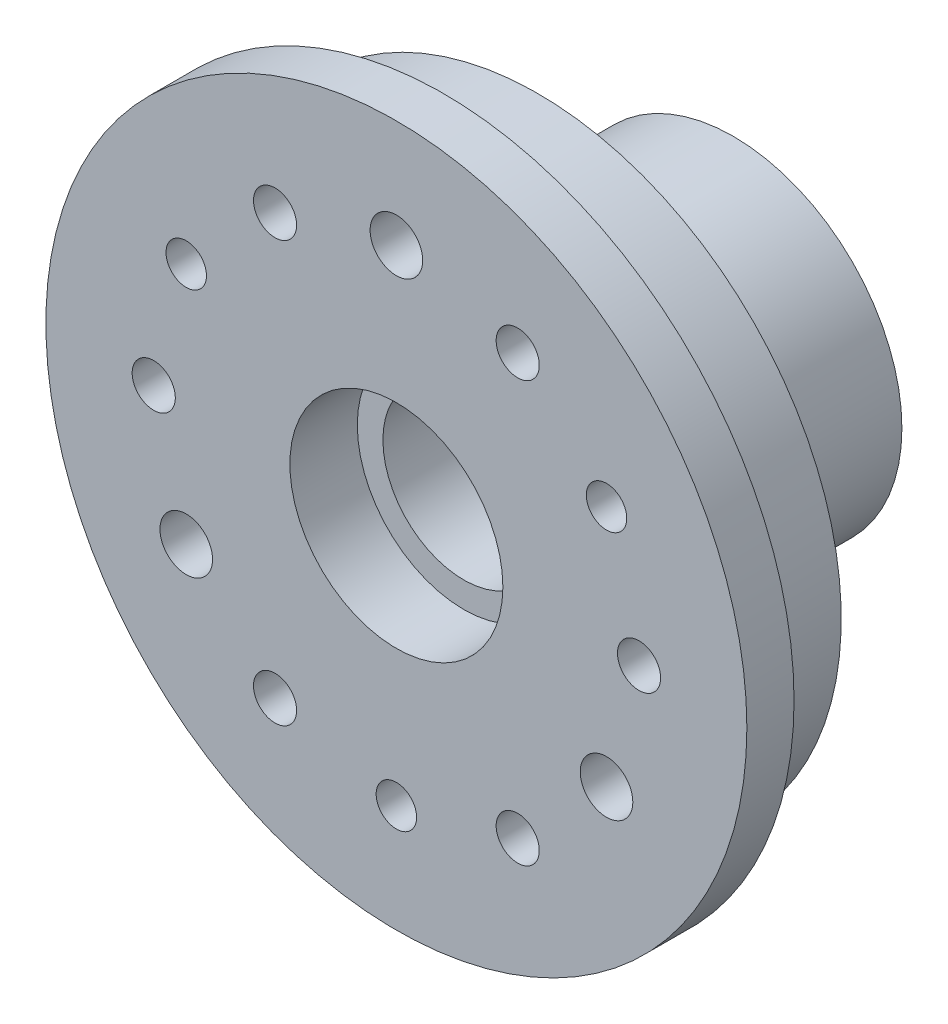
ISO-10303-21;
HEADER;
FILE_DESCRIPTION(('STEP AP214'),'2;1');
FILE_NAME('part.step','',(''),(''),'','','');
FILE_SCHEMA(('AUTOMOTIVE_DESIGN { 1 0 10303 214 1 1 1 1 }'));
ENDSEC;
DATA;
#1=APPLICATION_CONTEXT('core data for automotive mechanical design processes');
#2=APPLICATION_PROTOCOL_DEFINITION('international standard','automotive_design',2000,#1);
#3=PRODUCT_CONTEXT('',#1,'mechanical');
#4=PRODUCT('Part','Part','',(#3));
#5=PRODUCT_RELATED_PRODUCT_CATEGORY('part','',(#4));
#6=PRODUCT_DEFINITION_FORMATION('','',#4);
#7=PRODUCT_DEFINITION_CONTEXT('part definition',#1,'design');
#8=PRODUCT_DEFINITION('design','',#6,#7);
#9=PRODUCT_DEFINITION_SHAPE('','',#8);
#10=(LENGTH_UNIT() NAMED_UNIT(*) SI_UNIT(.MILLI.,.METRE.));
#11=(NAMED_UNIT(*) PLANE_ANGLE_UNIT() SI_UNIT($,.RADIAN.));
#12=(NAMED_UNIT(*) SI_UNIT($,.STERADIAN.) SOLID_ANGLE_UNIT());
#13=UNCERTAINTY_MEASURE_WITH_UNIT(LENGTH_MEASURE(1.E-05),#10,'distance_accuracy_value','');
#14=(GEOMETRIC_REPRESENTATION_CONTEXT(3) GLOBAL_UNCERTAINTY_ASSIGNED_CONTEXT((#13)) GLOBAL_UNIT_ASSIGNED_CONTEXT((#10,
#11,#12)) REPRESENTATION_CONTEXT('',''));
#15=CARTESIAN_POINT('',(0.,0.,0.));
#16=DIRECTION('',(0.,0.,1.));
#17=DIRECTION('',(1.,0.,0.));
#18=AXIS2_PLACEMENT_3D('',#15,#16,#17);
#19=CARTESIAN_POINT('',(-15.5884572681199,8.99999999999991,0.));
#20=DIRECTION('',(0.,0.,1.));
#21=DIRECTION('',(1.,0.,0.));
#22=AXIS2_PLACEMENT_3D('',#19,#20,#21);
#23=CYLINDRICAL_SURFACE('',#22,1.5);
#24=CARTESIAN_POINT('',(-15.5884572681199,8.99999999999991,20.));
#25=DIRECTION('',(0.,0.,1.));
#26=DIRECTION('',(1.,0.,0.));
#27=AXIS2_PLACEMENT_3D('',#24,#25,#26);
#28=CIRCLE('',#27,1.5);
#29=CARTESIAN_POINT('',(-14.0884572681199,8.99999999999991,20.));
#30=VERTEX_POINT('',#29);
#31=EDGE_CURVE('E175',#30,#30,#28,.T.);
#32=ORIENTED_EDGE('',*,*,#31,.T.);
#33=EDGE_LOOP('',(#32));
#34=FACE_BOUND('',#33,.T.);
#35=CARTESIAN_POINT('',(-15.5884572681199,8.99999999999991,14.5));
#36=DIRECTION('',(0.,0.,-1.));
#37=DIRECTION('',(-1.,0.,0.));
#38=AXIS2_PLACEMENT_3D('',#35,#36,#37);
#39=CIRCLE('',#38,1.5);
#40=CARTESIAN_POINT('',(-17.0884572681199,8.99999999999991,14.5));
#41=VERTEX_POINT('',#40);
#42=EDGE_CURVE('E75',#41,#41,#39,.F.);
#43=ORIENTED_EDGE('',*,*,#42,.F.);
#44=EDGE_LOOP('',(#43));
#45=FACE_BOUND('',#44,.T.);
#46=ADVANCED_FACE('F43',(#34,#45),#23,.F.);
#47=CARTESIAN_POINT('',(0.,-18.,0.));
#48=DIRECTION('',(0.,0.,1.));
#49=DIRECTION('',(1.,0.,0.));
#50=AXIS2_PLACEMENT_3D('',#47,#48,#49);
#51=CYLINDRICAL_SURFACE('',#50,1.5);
#52=CARTESIAN_POINT('',(0.,-18.,20.));
#53=DIRECTION('',(0.,0.,1.));
#54=DIRECTION('',(1.,0.,0.));
#55=AXIS2_PLACEMENT_3D('',#52,#53,#54);
#56=CIRCLE('',#55,1.5);
#57=CARTESIAN_POINT('',(1.5000000000001,-18.,20.));
#58=VERTEX_POINT('',#57);
#59=EDGE_CURVE('E180',#58,#58,#56,.T.);
#60=ORIENTED_EDGE('',*,*,#59,.T.);
#61=EDGE_LOOP('',(#60));
#62=FACE_BOUND('',#61,.T.);
#63=CARTESIAN_POINT('',(0.,-18.,14.5));
#64=DIRECTION('',(0.,0.,-1.));
#65=DIRECTION('',(-1.,0.,0.));
#66=AXIS2_PLACEMENT_3D('',#63,#64,#65);
#67=CIRCLE('',#66,1.5);
#68=CARTESIAN_POINT('',(-1.4999999999999,-18.,14.5));
#69=VERTEX_POINT('',#68);
#70=EDGE_CURVE('E71',#69,#69,#67,.F.);
#71=ORIENTED_EDGE('',*,*,#70,.F.);
#72=EDGE_LOOP('',(#71));
#73=FACE_BOUND('',#72,.T.);
#74=ADVANCED_FACE('F233',(#62,#73),#51,.F.);
#75=CARTESIAN_POINT('',(15.5884572681198,9.00000000000008,0.));
#76=DIRECTION('',(0.,0.,1.));
#77=DIRECTION('',(1.,0.,0.));
#78=AXIS2_PLACEMENT_3D('',#75,#76,#77);
#79=CYLINDRICAL_SURFACE('',#78,1.5);
#80=CARTESIAN_POINT('',(15.5884572681198,9.00000000000008,20.));
#81=DIRECTION('',(0.,0.,1.));
#82=DIRECTION('',(1.,0.,0.));
#83=AXIS2_PLACEMENT_3D('',#80,#81,#82);
#84=CIRCLE('',#83,1.5);
#85=CARTESIAN_POINT('',(17.0884572681198,9.00000000000008,20.));
#86=VERTEX_POINT('',#85);
#87=EDGE_CURVE('E176',#86,#86,#84,.T.);
#88=ORIENTED_EDGE('',*,*,#87,.T.);
#89=EDGE_LOOP('',(#88));
#90=FACE_BOUND('',#89,.T.);
#91=CARTESIAN_POINT('',(15.5884572681198,9.00000000000008,14.5));
#92=DIRECTION('',(0.,0.,-1.));
#93=DIRECTION('',(-1.,0.,0.));
#94=AXIS2_PLACEMENT_3D('',#91,#92,#93);
#95=CIRCLE('',#94,1.5);
#96=CARTESIAN_POINT('',(14.0884572681198,9.00000000000008,14.5));
#97=VERTEX_POINT('',#96);
#98=EDGE_CURVE('E65',#97,#97,#95,.F.);
#99=ORIENTED_EDGE('',*,*,#98,.F.);
#100=EDGE_LOOP('',(#99));
#101=FACE_BOUND('',#100,.T.);
#102=ADVANCED_FACE('F239',(#90,#101),#79,.F.);
#103=CARTESIAN_POINT('',(0.,0.,87.2106781186548));
#104=DIRECTION('',(0.,0.,-1.));
#105=DIRECTION('',(-1.,0.,0.));
#106=AXIS2_PLACEMENT_3D('',#103,#104,#105);
#107=CYLINDRICAL_SURFACE('',#106,22.5);
#108=CARTESIAN_POINT('',(0.,0.,16.5));
#109=DIRECTION('',(0.,0.,1.));
#110=DIRECTION('',(1.,0.,0.));
#111=AXIS2_PLACEMENT_3D('',#108,#109,#110);
#112=CIRCLE('',#111,22.5);
#113=CARTESIAN_POINT('',(22.5,0.,16.5));
#114=VERTEX_POINT('',#113);
#115=EDGE_CURVE('E147',#114,#114,#112,.F.);
#116=ORIENTED_EDGE('',*,*,#115,.T.);
#117=EDGE_LOOP('',(#116));
#118=FACE_BOUND('',#117,.T.);
#119=CARTESIAN_POINT('',(0.,0.,9.5));
#120=DIRECTION('',(0.,0.,-1.));
#121=DIRECTION('',(-1.,0.,0.));
#122=AXIS2_PLACEMENT_3D('',#119,#120,#121);
#123=CIRCLE('',#122,22.5);
#124=CARTESIAN_POINT('',(-22.5,0.,9.5));
#125=VERTEX_POINT('',#124);
#126=EDGE_CURVE('E143',#125,#125,#123,.T.);
#127=ORIENTED_EDGE('',*,*,#126,.F.);
#128=EDGE_LOOP('',(#127));
#129=FACE_BOUND('',#128,.T.);
#130=ADVANCED_FACE('F486',(#118,#129),#107,.T.);
#131=CARTESIAN_POINT('',(0.,0.,0.));
#132=DIRECTION('',(0.,0.,1.));
#133=DIRECTION('',(1.,0.,0.));
#134=AXIS2_PLACEMENT_3D('',#131,#132,#133);
#135=CYLINDRICAL_SURFACE('',#134,7.9);
#136=CARTESIAN_POINT('',(0.,0.,20.));
#137=DIRECTION('',(0.,0.,1.));
#138=DIRECTION('',(1.,0.,0.));
#139=AXIS2_PLACEMENT_3D('',#136,#137,#138);
#140=CIRCLE('',#139,7.9);
#141=CARTESIAN_POINT('',(7.9,0.,20.));
#142=VERTEX_POINT('',#141);
#143=EDGE_CURVE('E171',#142,#142,#140,.T.);
#144=ORIENTED_EDGE('',*,*,#143,.T.);
#145=EDGE_LOOP('',(#144));
#146=FACE_BOUND('',#145,.T.);
#147=CARTESIAN_POINT('',(0.,0.,15.));
#148=DIRECTION('',(0.,0.,-1.));
#149=DIRECTION('',(-1.,0.,0.));
#150=AXIS2_PLACEMENT_3D('',#147,#148,#149);
#151=CIRCLE('',#150,7.9);
#152=CARTESIAN_POINT('',(-7.9,0.,15.));
#153=VERTEX_POINT('',#152);
#154=EDGE_CURVE('E10',#153,#153,#151,.F.);
#155=ORIENTED_EDGE('',*,*,#154,.F.);
#156=EDGE_LOOP('',(#155));
#157=FACE_BOUND('',#156,.T.);
#158=ADVANCED_FACE('F212',(#146,#157),#135,.F.);
#159=CARTESIAN_POINT('',(0.,0.,20.));
#160=DIRECTION('',(0.,0.,1.));
#161=DIRECTION('',(1.,0.,0.));
#162=AXIS2_PLACEMENT_3D('',#159,#160,#161);
#163=PLANE('',#162);
#164=CARTESIAN_POINT('',(-18.,0.,20.));
#165=DIRECTION('',(0.,0.,1.));
#166=DIRECTION('',(0.499999999999998,0.86602540378444,0.));
#167=AXIS2_PLACEMENT_3D('',#164,#165,#166);
#168=CIRCLE('',#167,1.6);
#169=CARTESIAN_POINT('',(-17.2,1.38564064605501,20.));
#170=VERTEX_POINT('',#169);
#171=EDGE_CURVE('E92',#170,#170,#168,.T.);
#172=ORIENTED_EDGE('',*,*,#171,.F.);
#173=EDGE_LOOP('',(#172));
#174=FACE_BOUND('',#173,.T.);
#175=CARTESIAN_POINT('',(-8.99999999999989,-15.58845726812,20.));
#176=DIRECTION('',(0.,0.,1.));
#177=DIRECTION('',(-0.500000000000004,0.866025403784436,0.));
#178=AXIS2_PLACEMENT_3D('',#175,#176,#177);
#179=CIRCLE('',#178,1.6);
#180=CARTESIAN_POINT('',(-9.79999999999989,-14.2028166220649,20.));
#181=VERTEX_POINT('',#180);
#182=EDGE_CURVE('E656',#181,#181,#179,.T.);
#183=ORIENTED_EDGE('',*,*,#182,.F.);
#184=EDGE_LOOP('',(#183));
#185=FACE_BOUND('',#184,.T.);
#186=CARTESIAN_POINT('',(9.00000000000004,-15.5884572681199,20.));
#187=DIRECTION('',(0.,0.,1.));
#188=DIRECTION('',(-1.,0.,0.));
#189=AXIS2_PLACEMENT_3D('',#186,#187,#188);
#190=CIRCLE('',#189,1.6);
#191=CARTESIAN_POINT('',(7.40000000000004,-15.5884572681199,20.));
#192=VERTEX_POINT('',#191);
#193=EDGE_CURVE('E660',#192,#192,#190,.T.);
#194=ORIENTED_EDGE('',*,*,#193,.F.);
#195=EDGE_LOOP('',(#194));
#196=FACE_BOUND('',#195,.T.);
#197=CARTESIAN_POINT('',(18.,2.15105711021124E-13,20.));
#198=DIRECTION('',(0.,0.,1.));
#199=DIRECTION('',(-0.499999999999992,-0.866025403784443,0.));
#200=AXIS2_PLACEMENT_3D('',#197,#198,#199);
#201=CIRCLE('',#200,1.6);
#202=CARTESIAN_POINT('',(17.2,-1.38564064605489,20.));
#203=VERTEX_POINT('',#202);
#204=EDGE_CURVE('E663',#203,#203,#201,.T.);
#205=ORIENTED_EDGE('',*,*,#204,.F.);
#206=EDGE_LOOP('',(#205));
#207=FACE_BOUND('',#206,.T.);
#208=CARTESIAN_POINT('',(8.99999999999978,15.58845726812,20.));
#209=DIRECTION('',(0.,0.,1.));
#210=DIRECTION('',(0.50000000000001,-0.866025403784433,0.));
#211=AXIS2_PLACEMENT_3D('',#208,#209,#210);
#212=CIRCLE('',#211,1.6);
#213=CARTESIAN_POINT('',(9.79999999999979,14.2028166220649,20.));
#214=VERTEX_POINT('',#213);
#215=EDGE_CURVE('E118',#214,#214,#212,.T.);
#216=ORIENTED_EDGE('',*,*,#215,.F.);
#217=EDGE_LOOP('',(#216));
#218=FACE_BOUND('',#217,.T.);
#219=CARTESIAN_POINT('',(-9.00000000000004,15.5884572681199,20.));
#220=DIRECTION('',(0.,0.,1.));
#221=DIRECTION('',(1.,0.,0.));
#222=AXIS2_PLACEMENT_3D('',#219,#220,#221);
#223=CIRCLE('',#222,1.6);
#224=CARTESIAN_POINT('',(-7.40000000000004,15.5884572681199,20.));
#225=VERTEX_POINT('',#224);
#226=EDGE_CURVE('E86',#225,#225,#223,.T.);
#227=ORIENTED_EDGE('',*,*,#226,.F.);
#228=EDGE_LOOP('',(#227));
#229=FACE_BOUND('',#228,.T.);
#230=ORIENTED_EDGE('',*,*,#143,.F.);
#231=EDGE_LOOP('',(#230));
#232=FACE_BOUND('',#231,.T.);
#233=ORIENTED_EDGE('',*,*,#87,.F.);
#234=EDGE_LOOP('',(#233));
#235=FACE_BOUND('',#234,.T.);
#236=ORIENTED_EDGE('',*,*,#59,.F.);
#237=EDGE_LOOP('',(#236));
#238=FACE_BOUND('',#237,.T.);
#239=ORIENTED_EDGE('',*,*,#31,.F.);
#240=EDGE_LOOP('',(#239));
#241=FACE_BOUND('',#240,.T.);
#242=CARTESIAN_POINT('',(0.,18.,20.));
#243=DIRECTION('',(0.,0.,1.));
#244=DIRECTION('',(1.,0.,0.));
#245=AXIS2_PLACEMENT_3D('',#242,#243,#244);
#246=CIRCLE('',#245,1.95);
#247=CARTESIAN_POINT('',(1.95,18.,20.));
#248=VERTEX_POINT('',#247);
#249=EDGE_CURVE('E59',#248,#248,#246,.T.);
#250=ORIENTED_EDGE('',*,*,#249,.F.);
#251=EDGE_LOOP('',(#250));
#252=FACE_BOUND('',#251,.T.);
#253=CARTESIAN_POINT('',(15.5884572681199,-9.,20.));
#254=DIRECTION('',(0.,0.,1.));
#255=DIRECTION('',(1.,0.,0.));
#256=AXIS2_PLACEMENT_3D('',#253,#254,#255);
#257=CIRCLE('',#256,1.95);
#258=CARTESIAN_POINT('',(17.5384572681199,-9.,20.));
#259=VERTEX_POINT('',#258);
#260=EDGE_CURVE('E194',#259,#259,#257,.T.);
#261=ORIENTED_EDGE('',*,*,#260,.F.);
#262=EDGE_LOOP('',(#261));
#263=FACE_BOUND('',#262,.T.);
#264=CARTESIAN_POINT('',(-15.5884572681199,-9.00000000000001,20.));
#265=DIRECTION('',(0.,0.,1.));
#266=DIRECTION('',(1.,0.,0.));
#267=AXIS2_PLACEMENT_3D('',#264,#265,#266);
#268=CIRCLE('',#267,1.95);
#269=CARTESIAN_POINT('',(-13.6384572681199,-9.00000000000001,20.));
#270=VERTEX_POINT('',#269);
#271=EDGE_CURVE('E63',#270,#270,#268,.T.);
#272=ORIENTED_EDGE('',*,*,#271,.F.);
#273=EDGE_LOOP('',(#272));
#274=FACE_BOUND('',#273,.T.);
#275=CARTESIAN_POINT('',(0.,0.,20.));
#276=DIRECTION('',(0.,0.,1.));
#277=DIRECTION('',(1.,0.,0.));
#278=AXIS2_PLACEMENT_3D('',#275,#276,#277);
#279=CIRCLE('',#278,26.);
#280=CARTESIAN_POINT('',(26.,0.,20.));
#281=VERTEX_POINT('',#280);
#282=EDGE_CURVE('E151',#281,#281,#279,.T.);
#283=ORIENTED_EDGE('',*,*,#282,.T.);
#284=EDGE_LOOP('',(#283));
#285=FACE_BOUND('',#284,.T.);
#286=ADVANCED_FACE('F45',(#174,#185,#196,#207,#218,#229,#232,#235,#238,#241,#252,#263,#274,
#285),#163,.T.);
#287=CARTESIAN_POINT('',(-15.5884572681199,-9.00000000000001,16.));
#288=DIRECTION('',(0.,0.,1.));
#289=DIRECTION('',(1.,0.,0.));
#290=AXIS2_PLACEMENT_3D('',#287,#288,#289);
#291=CYLINDRICAL_SURFACE('',#290,1.95);
#292=CARTESIAN_POINT('',(-15.5884572681199,-9.00000000000001,16.));
#293=DIRECTION('',(0.,0.,1.));
#294=DIRECTION('',(1.,0.,0.));
#295=AXIS2_PLACEMENT_3D('',#292,#293,#294);
#296=CIRCLE('',#295,1.95);
#297=CARTESIAN_POINT('',(-13.6384572681199,-9.00000000000001,16.));
#298=VERTEX_POINT('',#297);
#299=EDGE_CURVE('E197',#298,#298,#296,.T.);
#300=ORIENTED_EDGE('',*,*,#299,.F.);
#301=EDGE_LOOP('',(#300));
#302=FACE_BOUND('',#301,.T.);
#303=ORIENTED_EDGE('',*,*,#271,.T.);
#304=EDGE_LOOP('',(#303));
#305=FACE_BOUND('',#304,.T.);
#306=ADVANCED_FACE('F208',(#302,#305),#291,.F.);
#307=CARTESIAN_POINT('',(-15.5884572681199,-9.00000000000001,16.));
#308=DIRECTION('',(0.,0.,1.));
#309=DIRECTION('',(1.,0.,0.));
#310=AXIS2_PLACEMENT_3D('',#307,#308,#309);
#311=PLANE('',#310);
#312=ORIENTED_EDGE('',*,*,#299,.T.);
#313=EDGE_LOOP('',(#312));
#314=FACE_BOUND('',#313,.T.);
#315=ADVANCED_FACE('F261',(#314),#311,.T.);
#316=CARTESIAN_POINT('',(15.5884572681199,-9.,16.));
#317=DIRECTION('',(0.,0.,1.));
#318=DIRECTION('',(1.,0.,0.));
#319=AXIS2_PLACEMENT_3D('',#316,#317,#318);
#320=CYLINDRICAL_SURFACE('',#319,1.95);
#321=CARTESIAN_POINT('',(15.5884572681199,-9.,16.));
#322=DIRECTION('',(0.,0.,1.));
#323=DIRECTION('',(1.,0.,0.));
#324=AXIS2_PLACEMENT_3D('',#321,#322,#323);
#325=CIRCLE('',#324,1.95);
#326=CARTESIAN_POINT('',(17.5384572681199,-9.,16.));
#327=VERTEX_POINT('',#326);
#328=EDGE_CURVE('E190',#327,#327,#325,.T.);
#329=ORIENTED_EDGE('',*,*,#328,.F.);
#330=EDGE_LOOP('',(#329));
#331=FACE_BOUND('',#330,.T.);
#332=ORIENTED_EDGE('',*,*,#260,.T.);
#333=EDGE_LOOP('',(#332));
#334=FACE_BOUND('',#333,.T.);
#335=ADVANCED_FACE('F257',(#331,#334),#320,.F.);
#336=CARTESIAN_POINT('',(15.5884572681199,-9.,16.));
#337=DIRECTION('',(0.,0.,1.));
#338=DIRECTION('',(1.,0.,0.));
#339=AXIS2_PLACEMENT_3D('',#336,#337,#338);
#340=PLANE('',#339);
#341=ORIENTED_EDGE('',*,*,#328,.T.);
#342=EDGE_LOOP('',(#341));
#343=FACE_BOUND('',#342,.T.);
#344=ADVANCED_FACE('F253',(#343),#340,.T.);
#345=CARTESIAN_POINT('',(0.,18.,16.));
#346=DIRECTION('',(0.,0.,1.));
#347=DIRECTION('',(1.,0.,0.));
#348=AXIS2_PLACEMENT_3D('',#345,#346,#347);
#349=CYLINDRICAL_SURFACE('',#348,1.95);
#350=CARTESIAN_POINT('',(0.,18.,16.));
#351=DIRECTION('',(0.,0.,1.));
#352=DIRECTION('',(1.,0.,0.));
#353=AXIS2_PLACEMENT_3D('',#350,#351,#352);
#354=CIRCLE('',#353,1.95);
#355=CARTESIAN_POINT('',(1.95,18.,16.));
#356=VERTEX_POINT('',#355);
#357=EDGE_CURVE('E52',#356,#356,#354,.T.);
#358=ORIENTED_EDGE('',*,*,#357,.F.);
#359=EDGE_LOOP('',(#358));
#360=FACE_BOUND('',#359,.T.);
#361=ORIENTED_EDGE('',*,*,#249,.T.);
#362=EDGE_LOOP('',(#361));
#363=FACE_BOUND('',#362,.T.);
#364=ADVANCED_FACE('F249',(#360,#363),#349,.F.);
#365=CARTESIAN_POINT('',(0.,18.,16.));
#366=DIRECTION('',(0.,0.,1.));
#367=DIRECTION('',(1.,0.,0.));
#368=AXIS2_PLACEMENT_3D('',#365,#366,#367);
#369=PLANE('',#368);
#370=ORIENTED_EDGE('',*,*,#357,.T.);
#371=EDGE_LOOP('',(#370));
#372=FACE_BOUND('',#371,.T.);
#373=ADVANCED_FACE('F245',(#372),#369,.T.);
#374=CARTESIAN_POINT('',(0.,0.,6.));
#375=DIRECTION('',(0.,0.,-1.));
#376=DIRECTION('',(-1.,0.,0.));
#377=AXIS2_PLACEMENT_3D('',#374,#375,#376);
#378=CIRCLE('',#377,7.9);
#379=CARTESIAN_POINT('',(-7.9,0.,6.));
#380=VERTEX_POINT('',#379);
#381=EDGE_CURVE('E164',#380,#380,#378,.T.);
#382=ORIENTED_EDGE('',*,*,#381,.F.);
#383=EDGE_LOOP('',(#382));
#384=FACE_BOUND('',#383,.T.);
#385=CARTESIAN_POINT('',(0.,0.,-5.));
#386=DIRECTION('',(0.,0.,-1.));
#387=DIRECTION('',(-1.,0.,0.));
#388=AXIS2_PLACEMENT_3D('',#385,#386,#387);
#389=CIRCLE('',#388,7.9);
#390=CARTESIAN_POINT('',(-7.9,0.,-5.));
#391=VERTEX_POINT('',#390);
#392=EDGE_CURVE('E645',#391,#391,#389,.T.);
#393=ORIENTED_EDGE('',*,*,#392,.T.);
#394=EDGE_LOOP('',(#393));
#395=FACE_BOUND('',#394,.T.);
#396=ADVANCED_FACE('F248',(#384,#395),#135,.F.);
#397=CARTESIAN_POINT('',(0.,0.,15.));
#398=DIRECTION('',(0.,0.,-1.));
#399=DIRECTION('',(-1.,0.,0.));
#400=AXIS2_PLACEMENT_3D('',#397,#398,#399);
#401=PLANE('',#400);
#402=CARTESIAN_POINT('',(0.,0.,15.));
#403=DIRECTION('',(0.,0.,-1.));
#404=DIRECTION('',(-1.,0.,0.));
#405=AXIS2_PLACEMENT_3D('',#402,#403,#404);
#406=CIRCLE('',#405,6.);
#407=CARTESIAN_POINT('',(-6.,0.,15.));
#408=VERTEX_POINT('',#407);
#409=EDGE_CURVE('E160',#408,#408,#406,.T.);
#410=ORIENTED_EDGE('',*,*,#409,.T.);
#411=EDGE_LOOP('',(#410));
#412=FACE_BOUND('',#411,.T.);
#413=ORIENTED_EDGE('',*,*,#154,.T.);
#414=EDGE_LOOP('',(#413));
#415=FACE_BOUND('',#414,.T.);
#416=ADVANCED_FACE('F298',(#412,#415),#401,.F.);
#417=CARTESIAN_POINT('',(0.,0.,6.));
#418=DIRECTION('',(0.,0.,-1.));
#419=DIRECTION('',(-1.,0.,0.));
#420=AXIS2_PLACEMENT_3D('',#417,#418,#419);
#421=PLANE('',#420);
#422=CARTESIAN_POINT('',(0.,0.,6.));
#423=DIRECTION('',(0.,0.,-1.));
#424=DIRECTION('',(-1.,0.,0.));
#425=AXIS2_PLACEMENT_3D('',#422,#423,#424);
#426=CIRCLE('',#425,6.);
#427=CARTESIAN_POINT('',(-6.,0.,6.));
#428=VERTEX_POINT('',#427);
#429=EDGE_CURVE('E156',#428,#428,#426,.T.);
#430=ORIENTED_EDGE('',*,*,#429,.F.);
#431=EDGE_LOOP('',(#430));
#432=FACE_BOUND('',#431,.T.);
#433=ORIENTED_EDGE('',*,*,#381,.T.);
#434=EDGE_LOOP('',(#433));
#435=FACE_BOUND('',#434,.T.);
#436=ADVANCED_FACE('F229',(#432,#435),#421,.T.);
#437=CARTESIAN_POINT('',(0.,0.,15.));
#438=DIRECTION('',(0.,0.,-1.));
#439=DIRECTION('',(-1.,0.,0.));
#440=AXIS2_PLACEMENT_3D('',#437,#438,#439);
#441=CYLINDRICAL_SURFACE('',#440,6.);
#442=ORIENTED_EDGE('',*,*,#409,.F.);
#443=EDGE_LOOP('',(#442));
#444=FACE_BOUND('',#443,.T.);
#445=ORIENTED_EDGE('',*,*,#429,.T.);
#446=EDGE_LOOP('',(#445));
#447=FACE_BOUND('',#446,.T.);
#448=ADVANCED_FACE('F219',(#444,#447),#441,.F.);
#449=CARTESIAN_POINT('',(0.,0.,16.5));
#450=DIRECTION('',(0.,0.,1.));
#451=DIRECTION('',(1.,0.,0.));
#452=AXIS2_PLACEMENT_3D('',#449,#450,#451);
#453=CYLINDRICAL_SURFACE('',#452,26.);
#454=CARTESIAN_POINT('',(0.,0.,16.5));
#455=DIRECTION('',(0.,0.,1.));
#456=DIRECTION('',(1.,0.,0.));
#457=AXIS2_PLACEMENT_3D('',#454,#455,#456);
#458=CIRCLE('',#457,26.);
#459=CARTESIAN_POINT('',(26.,0.,16.5));
#460=VERTEX_POINT('',#459);
#461=EDGE_CURVE('E152',#460,#460,#458,.T.);
#462=ORIENTED_EDGE('',*,*,#461,.T.);
#463=EDGE_LOOP('',(#462));
#464=FACE_BOUND('',#463,.T.);
#465=ORIENTED_EDGE('',*,*,#282,.F.);
#466=EDGE_LOOP('',(#465));
#467=FACE_BOUND('',#466,.T.);
#468=ADVANCED_FACE('F216',(#464,#467),#453,.T.);
#469=CARTESIAN_POINT('',(0.,0.,16.5));
#470=DIRECTION('',(0.,0.,1.));
#471=DIRECTION('',(1.,0.,0.));
#472=AXIS2_PLACEMENT_3D('',#469,#470,#471);
#473=PLANE('',#472);
#474=ORIENTED_EDGE('',*,*,#461,.F.);
#475=EDGE_LOOP('',(#474));
#476=FACE_BOUND('',#475,.T.);
#477=ORIENTED_EDGE('',*,*,#115,.F.);
#478=EDGE_LOOP('',(#477));
#479=FACE_BOUND('',#478,.T.);
#480=ADVANCED_FACE('F218',(#476,#479),#473,.F.);
#481=CARTESIAN_POINT('',(0.,0.,9.5));
#482=DIRECTION('',(0.,0.,-1.));
#483=DIRECTION('',(-1.,0.,0.));
#484=AXIS2_PLACEMENT_3D('',#481,#482,#483);
#485=PLANE('',#484);
#486=CARTESIAN_POINT('',(-18.,0.,9.5));
#487=DIRECTION('',(0.,0.,-1.));
#488=DIRECTION('',(-1.,0.,0.));
#489=AXIS2_PLACEMENT_3D('',#486,#487,#488);
#490=CIRCLE('',#489,1.6);
#491=CARTESIAN_POINT('',(-19.6,0.,9.5));
#492=VERTEX_POINT('',#491);
#493=EDGE_CURVE('E47',#492,#492,#490,.T.);
#494=ORIENTED_EDGE('',*,*,#493,.F.);
#495=EDGE_LOOP('',(#494));
#496=FACE_BOUND('',#495,.T.);
#497=CARTESIAN_POINT('',(-8.99999999999989,-15.58845726812,9.5));
#498=DIRECTION('',(0.,0.,-1.));
#499=DIRECTION('',(-1.,0.,0.));
#500=AXIS2_PLACEMENT_3D('',#497,#498,#499);
#501=CIRCLE('',#500,1.6);
#502=CARTESIAN_POINT('',(-10.5999999999999,-15.58845726812,9.5));
#503=VERTEX_POINT('',#502);
#504=EDGE_CURVE('E99',#503,#503,#501,.T.);
#505=ORIENTED_EDGE('',*,*,#504,.F.);
#506=EDGE_LOOP('',(#505));
#507=FACE_BOUND('',#506,.T.);
#508=CARTESIAN_POINT('',(9.00000000000004,-15.5884572681199,9.5));
#509=DIRECTION('',(0.,0.,-1.));
#510=DIRECTION('',(-1.,0.,0.));
#511=AXIS2_PLACEMENT_3D('',#508,#509,#510);
#512=CIRCLE('',#511,1.6);
#513=CARTESIAN_POINT('',(7.40000000000004,-15.5884572681199,9.5));
#514=VERTEX_POINT('',#513);
#515=EDGE_CURVE('E96',#514,#514,#512,.T.);
#516=ORIENTED_EDGE('',*,*,#515,.F.);
#517=EDGE_LOOP('',(#516));
#518=FACE_BOUND('',#517,.T.);
#519=CARTESIAN_POINT('',(18.,2.15105711021124E-13,9.5));
#520=DIRECTION('',(0.,0.,-1.));
#521=DIRECTION('',(-1.,0.,0.));
#522=AXIS2_PLACEMENT_3D('',#519,#520,#521);
#523=CIRCLE('',#522,1.6);
#524=CARTESIAN_POINT('',(16.4,2.15105711021124E-13,9.5));
#525=VERTEX_POINT('',#524);
#526=EDGE_CURVE('E91',#525,#525,#523,.T.);
#527=ORIENTED_EDGE('',*,*,#526,.F.);
#528=EDGE_LOOP('',(#527));
#529=FACE_BOUND('',#528,.T.);
#530=CARTESIAN_POINT('',(8.99999999999978,15.58845726812,9.5));
#531=DIRECTION('',(0.,0.,-1.));
#532=DIRECTION('',(-1.,0.,0.));
#533=AXIS2_PLACEMENT_3D('',#530,#531,#532);
#534=CIRCLE('',#533,1.6);
#535=CARTESIAN_POINT('',(7.39999999999978,15.58845726812,9.5));
#536=VERTEX_POINT('',#535);
#537=EDGE_CURVE('E87',#536,#536,#534,.T.);
#538=ORIENTED_EDGE('',*,*,#537,.F.);
#539=EDGE_LOOP('',(#538));
#540=FACE_BOUND('',#539,.T.);
#541=CARTESIAN_POINT('',(-9.00000000000004,15.5884572681199,9.5));
#542=DIRECTION('',(0.,0.,-1.));
#543=DIRECTION('',(-1.,0.,0.));
#544=AXIS2_PLACEMENT_3D('',#541,#542,#543);
#545=CIRCLE('',#544,1.6);
#546=CARTESIAN_POINT('',(-10.6,15.5884572681199,9.5));
#547=VERTEX_POINT('',#546);
#548=EDGE_CURVE('E81',#547,#547,#545,.T.);
#549=ORIENTED_EDGE('',*,*,#548,.F.);
#550=EDGE_LOOP('',(#549));
#551=FACE_BOUND('',#550,.T.);
#552=CARTESIAN_POINT('',(-15.58845726812,8.99999999999985,9.5));
#553=DIRECTION('',(0.,0.,-1.));
#554=DIRECTION('',(0.500000000000004,-0.866025403784436,0.));
#555=AXIS2_PLACEMENT_3D('',#552,#553,#554);
#556=CIRCLE('',#555,3.);
#557=CARTESIAN_POINT('',(-14.08845726812,6.40192378864654,9.5));
#558=VERTEX_POINT('',#557);
#559=EDGE_CURVE('E123',#558,#558,#556,.T.);
#560=ORIENTED_EDGE('',*,*,#559,.F.);
#561=EDGE_LOOP('',(#560));
#562=FACE_BOUND('',#561,.T.);
#563=CARTESIAN_POINT('',(2.57606436182556E-13,-18.,9.5));
#564=DIRECTION('',(0.,0.,-1.));
#565=DIRECTION('',(0.499999999999992,0.866025403784443,0.));
#566=AXIS2_PLACEMENT_3D('',#563,#564,#565);
#567=CIRCLE('',#566,3.);
#568=CARTESIAN_POINT('',(1.50000000000023,-15.4019237886467,9.5));
#569=VERTEX_POINT('',#568);
#570=EDGE_CURVE('E85',#569,#569,#567,.T.);
#571=ORIENTED_EDGE('',*,*,#570,.F.);
#572=EDGE_LOOP('',(#571));
#573=FACE_BOUND('',#572,.T.);
#574=CARTESIAN_POINT('',(15.5884572681198,9.00000000000008,9.5));
#575=DIRECTION('',(0.,0.,-1.));
#576=DIRECTION('',(-1.,0.,0.));
#577=AXIS2_PLACEMENT_3D('',#574,#575,#576);
#578=CIRCLE('',#577,3.);
#579=CARTESIAN_POINT('',(12.5884572681198,9.00000000000008,9.5));
#580=VERTEX_POINT('',#579);
#581=EDGE_CURVE('E80',#580,#580,#578,.T.);
#582=ORIENTED_EDGE('',*,*,#581,.F.);
#583=EDGE_LOOP('',(#582));
#584=FACE_BOUND('',#583,.T.);
#585=CARTESIAN_POINT('',(0.,0.,9.5));
#586=DIRECTION('',(0.,0.,-1.));
#587=DIRECTION('',(-1.,0.,0.));
#588=AXIS2_PLACEMENT_3D('',#585,#586,#587);
#589=CIRCLE('',#588,12.5);
#590=CARTESIAN_POINT('',(-12.5,0.,9.5));
#591=VERTEX_POINT('',#590);
#592=EDGE_CURVE('E69',#591,#591,#589,.T.);
#593=ORIENTED_EDGE('',*,*,#592,.F.);
#594=EDGE_LOOP('',(#593));
#595=FACE_BOUND('',#594,.T.);
#596=ORIENTED_EDGE('',*,*,#126,.T.);
#597=EDGE_LOOP('',(#596));
#598=FACE_BOUND('',#597,.T.);
#599=ADVANCED_FACE('F226',(#496,#507,#518,#529,#540,#551,#562,#573,#584,#595,#598),#485,.T.);
#600=CARTESIAN_POINT('',(0.,0.,9.5));
#601=DIRECTION('',(0.,0.,-1.));
#602=DIRECTION('',(-1.,0.,0.));
#603=AXIS2_PLACEMENT_3D('',#600,#601,#602);
#604=CYLINDRICAL_SURFACE('',#603,12.5);
#605=ORIENTED_EDGE('',*,*,#592,.T.);
#606=EDGE_LOOP('',(#605));
#607=FACE_BOUND('',#606,.T.);
#608=CARTESIAN_POINT('',(0.,0.,-5.));
#609=DIRECTION('',(0.,0.,-1.));
#610=DIRECTION('',(-1.,0.,0.));
#611=AXIS2_PLACEMENT_3D('',#608,#609,#610);
#612=CIRCLE('',#611,12.5);
#613=CARTESIAN_POINT('',(-12.5,0.,-5.));
#614=VERTEX_POINT('',#613);
#615=EDGE_CURVE('E642',#614,#614,#612,.T.);
#616=ORIENTED_EDGE('',*,*,#615,.F.);
#617=EDGE_LOOP('',(#616));
#618=FACE_BOUND('',#617,.T.);
#619=ADVANCED_FACE('F338',(#607,#618),#604,.T.);
#620=CARTESIAN_POINT('',(15.5884572681198,9.00000000000008,14.5));
#621=DIRECTION('',(0.,0.,-1.));
#622=DIRECTION('',(-1.,0.,0.));
#623=AXIS2_PLACEMENT_3D('',#620,#621,#622);
#624=PLANE('',#623);
#625=CARTESIAN_POINT('',(15.5884572681198,9.00000000000008,14.5));
#626=DIRECTION('',(0.,0.,-1.));
#627=DIRECTION('',(-1.,0.,0.));
#628=AXIS2_PLACEMENT_3D('',#625,#626,#627);
#629=CIRCLE('',#628,3.);
#630=CARTESIAN_POINT('',(12.5884572681198,9.00000000000008,14.5));
#631=VERTEX_POINT('',#630);
#632=EDGE_CURVE('E70',#631,#631,#629,.T.);
#633=ORIENTED_EDGE('',*,*,#632,.T.);
#634=EDGE_LOOP('',(#633));
#635=FACE_BOUND('',#634,.T.);
#636=ORIENTED_EDGE('',*,*,#98,.T.);
#637=EDGE_LOOP('',(#636));
#638=FACE_BOUND('',#637,.T.);
#639=ADVANCED_FACE('F350',(#635,#638),#624,.T.);
#640=CARTESIAN_POINT('',(15.5884572681198,9.00000000000008,14.5));
#641=DIRECTION('',(0.,0.,-1.));
#642=DIRECTION('',(-1.,0.,0.));
#643=AXIS2_PLACEMENT_3D('',#640,#641,#642);
#644=CYLINDRICAL_SURFACE('',#643,3.);
#645=ORIENTED_EDGE('',*,*,#632,.F.);
#646=EDGE_LOOP('',(#645));
#647=FACE_BOUND('',#646,.T.);
#648=ORIENTED_EDGE('',*,*,#581,.T.);
#649=EDGE_LOOP('',(#648));
#650=FACE_BOUND('',#649,.T.);
#651=ADVANCED_FACE('F361',(#647,#650),#644,.F.);
#652=CARTESIAN_POINT('',(2.57606436182556E-13,-18.,14.5));
#653=DIRECTION('',(0.,0.,-1.));
#654=DIRECTION('',(0.499999999999992,0.866025403784443,0.));
#655=AXIS2_PLACEMENT_3D('',#652,#653,#654);
#656=PLANE('',#655);
#657=CARTESIAN_POINT('',(2.57606436182556E-13,-18.,14.5));
#658=DIRECTION('',(0.,0.,-1.));
#659=DIRECTION('',(0.499999999999992,0.866025403784443,0.));
#660=AXIS2_PLACEMENT_3D('',#657,#658,#659);
#661=CIRCLE('',#660,3.);
#662=CARTESIAN_POINT('',(1.50000000000023,-15.4019237886467,14.5));
#663=VERTEX_POINT('',#662);
#664=EDGE_CURVE('E127',#663,#663,#661,.T.);
#665=ORIENTED_EDGE('',*,*,#664,.T.);
#666=EDGE_LOOP('',(#665));
#667=FACE_BOUND('',#666,.T.);
#668=ORIENTED_EDGE('',*,*,#70,.T.);
#669=EDGE_LOOP('',(#668));
#670=FACE_BOUND('',#669,.T.);
#671=ADVANCED_FACE('F372',(#667,#670),#656,.T.);
#672=CARTESIAN_POINT('',(2.57606436182556E-13,-18.,14.5));
#673=DIRECTION('',(0.,0.,-1.));
#674=DIRECTION('',(-1.,0.,0.));
#675=AXIS2_PLACEMENT_3D('',#672,#673,#674);
#676=CYLINDRICAL_SURFACE('',#675,3.);
#677=ORIENTED_EDGE('',*,*,#664,.F.);
#678=EDGE_LOOP('',(#677));
#679=FACE_BOUND('',#678,.T.);
#680=ORIENTED_EDGE('',*,*,#570,.T.);
#681=EDGE_LOOP('',(#680));
#682=FACE_BOUND('',#681,.T.);
#683=ADVANCED_FACE('F383',(#679,#682),#676,.F.);
#684=CARTESIAN_POINT('',(-15.58845726812,8.99999999999985,14.5));
#685=DIRECTION('',(0.,0.,-1.));
#686=DIRECTION('',(0.500000000000004,-0.866025403784436,0.));
#687=AXIS2_PLACEMENT_3D('',#684,#685,#686);
#688=PLANE('',#687);
#689=CARTESIAN_POINT('',(-15.58845726812,8.99999999999985,14.5));
#690=DIRECTION('',(0.,0.,-1.));
#691=DIRECTION('',(0.500000000000004,-0.866025403784436,0.));
#692=AXIS2_PLACEMENT_3D('',#689,#690,#691);
#693=CIRCLE('',#692,3.);
#694=CARTESIAN_POINT('',(-14.08845726812,6.40192378864654,14.5));
#695=VERTEX_POINT('',#694);
#696=EDGE_CURVE('E76',#695,#695,#693,.T.);
#697=ORIENTED_EDGE('',*,*,#696,.T.);
#698=EDGE_LOOP('',(#697));
#699=FACE_BOUND('',#698,.T.);
#700=ORIENTED_EDGE('',*,*,#42,.T.);
#701=EDGE_LOOP('',(#700));
#702=FACE_BOUND('',#701,.T.);
#703=ADVANCED_FACE('F394',(#699,#702),#688,.T.);
#704=CARTESIAN_POINT('',(-15.58845726812,8.99999999999985,14.5));
#705=DIRECTION('',(0.,0.,-1.));
#706=DIRECTION('',(-1.,0.,0.));
#707=AXIS2_PLACEMENT_3D('',#704,#705,#706);
#708=CYLINDRICAL_SURFACE('',#707,3.);
#709=ORIENTED_EDGE('',*,*,#696,.F.);
#710=EDGE_LOOP('',(#709));
#711=FACE_BOUND('',#710,.T.);
#712=ORIENTED_EDGE('',*,*,#559,.T.);
#713=EDGE_LOOP('',(#712));
#714=FACE_BOUND('',#713,.T.);
#715=ADVANCED_FACE('F404',(#711,#714),#708,.F.);
#716=CARTESIAN_POINT('',(-9.00000000000004,15.5884572681199,0.));
#717=DIRECTION('',(0.,0.,1.));
#718=DIRECTION('',(1.,0.,0.));
#719=AXIS2_PLACEMENT_3D('',#716,#717,#718);
#720=CYLINDRICAL_SURFACE('',#719,1.6);
#721=ORIENTED_EDGE('',*,*,#548,.T.);
#722=EDGE_LOOP('',(#721));
#723=FACE_BOUND('',#722,.T.);
#724=ORIENTED_EDGE('',*,*,#226,.T.);
#725=EDGE_LOOP('',(#724));
#726=FACE_BOUND('',#725,.T.);
#727=ADVANCED_FACE('F414',(#723,#726),#720,.F.);
#728=CARTESIAN_POINT('',(8.99999999999978,15.58845726812,0.));
#729=DIRECTION('',(0.,0.,1.));
#730=DIRECTION('',(1.,0.,0.));
#731=AXIS2_PLACEMENT_3D('',#728,#729,#730);
#732=CYLINDRICAL_SURFACE('',#731,1.6);
#733=ORIENTED_EDGE('',*,*,#537,.T.);
#734=EDGE_LOOP('',(#733));
#735=FACE_BOUND('',#734,.T.);
#736=ORIENTED_EDGE('',*,*,#215,.T.);
#737=EDGE_LOOP('',(#736));
#738=FACE_BOUND('',#737,.T.);
#739=ADVANCED_FACE('F424',(#735,#738),#732,.F.);
#740=CARTESIAN_POINT('',(18.,2.15105711021124E-13,0.));
#741=DIRECTION('',(0.,0.,1.));
#742=DIRECTION('',(1.,0.,0.));
#743=AXIS2_PLACEMENT_3D('',#740,#741,#742);
#744=CYLINDRICAL_SURFACE('',#743,1.6);
#745=ORIENTED_EDGE('',*,*,#526,.T.);
#746=EDGE_LOOP('',(#745));
#747=FACE_BOUND('',#746,.T.);
#748=ORIENTED_EDGE('',*,*,#204,.T.);
#749=EDGE_LOOP('',(#748));
#750=FACE_BOUND('',#749,.T.);
#751=ADVANCED_FACE('F433',(#747,#750),#744,.F.);
#752=CARTESIAN_POINT('',(9.00000000000004,-15.5884572681199,0.));
#753=DIRECTION('',(0.,0.,1.));
#754=DIRECTION('',(1.,0.,0.));
#755=AXIS2_PLACEMENT_3D('',#752,#753,#754);
#756=CYLINDRICAL_SURFACE('',#755,1.6);
#757=ORIENTED_EDGE('',*,*,#515,.T.);
#758=EDGE_LOOP('',(#757));
#759=FACE_BOUND('',#758,.T.);
#760=ORIENTED_EDGE('',*,*,#193,.T.);
#761=EDGE_LOOP('',(#760));
#762=FACE_BOUND('',#761,.T.);
#763=ADVANCED_FACE('F443',(#759,#762),#756,.F.);
#764=CARTESIAN_POINT('',(-8.99999999999989,-15.58845726812,0.));
#765=DIRECTION('',(0.,0.,1.));
#766=DIRECTION('',(1.,0.,0.));
#767=AXIS2_PLACEMENT_3D('',#764,#765,#766);
#768=CYLINDRICAL_SURFACE('',#767,1.6);
#769=ORIENTED_EDGE('',*,*,#504,.T.);
#770=EDGE_LOOP('',(#769));
#771=FACE_BOUND('',#770,.T.);
#772=ORIENTED_EDGE('',*,*,#182,.T.);
#773=EDGE_LOOP('',(#772));
#774=FACE_BOUND('',#773,.T.);
#775=ADVANCED_FACE('F453',(#771,#774),#768,.F.);
#776=CARTESIAN_POINT('',(-18.,0.,0.));
#777=DIRECTION('',(0.,0.,1.));
#778=DIRECTION('',(1.,0.,0.));
#779=AXIS2_PLACEMENT_3D('',#776,#777,#778);
#780=CYLINDRICAL_SURFACE('',#779,1.6);
#781=ORIENTED_EDGE('',*,*,#493,.T.);
#782=EDGE_LOOP('',(#781));
#783=FACE_BOUND('',#782,.T.);
#784=ORIENTED_EDGE('',*,*,#171,.T.);
#785=EDGE_LOOP('',(#784));
#786=FACE_BOUND('',#785,.T.);
#787=ADVANCED_FACE('F463',(#783,#786),#780,.F.);
#788=CARTESIAN_POINT('',(0.,0.,-5.));
#789=DIRECTION('',(0.,0.,-1.));
#790=DIRECTION('',(-1.,0.,0.));
#791=AXIS2_PLACEMENT_3D('',#788,#789,#790);
#792=PLANE('',#791);
#793=ORIENTED_EDGE('',*,*,#615,.T.);
#794=EDGE_LOOP('',(#793));
#795=FACE_BOUND('',#794,.T.);
#796=ORIENTED_EDGE('',*,*,#392,.F.);
#797=EDGE_LOOP('',(#796));
#798=FACE_BOUND('',#797,.T.);
#799=ADVANCED_FACE('F472',(#795,#798),#792,.T.);
#800=CLOSED_SHELL('',(#46,#74,#102,#130,#158,#286,#306,#315,#335,#344,#364,#373,#396,#416,#436,
#448,#468,#480,#599,#619,#639,#651,#671,#683,#703,#715,#727,#739,#751,#763,#775,#787,#799));
#801=MANIFOLD_SOLID_BREP('B2',#800);
#802=ADVANCED_BREP_SHAPE_REPRESENTATION('',(#18,#801),#14);
#803=SHAPE_DEFINITION_REPRESENTATION(#9,#802);
ENDSEC;
END-ISO-10303-21;
